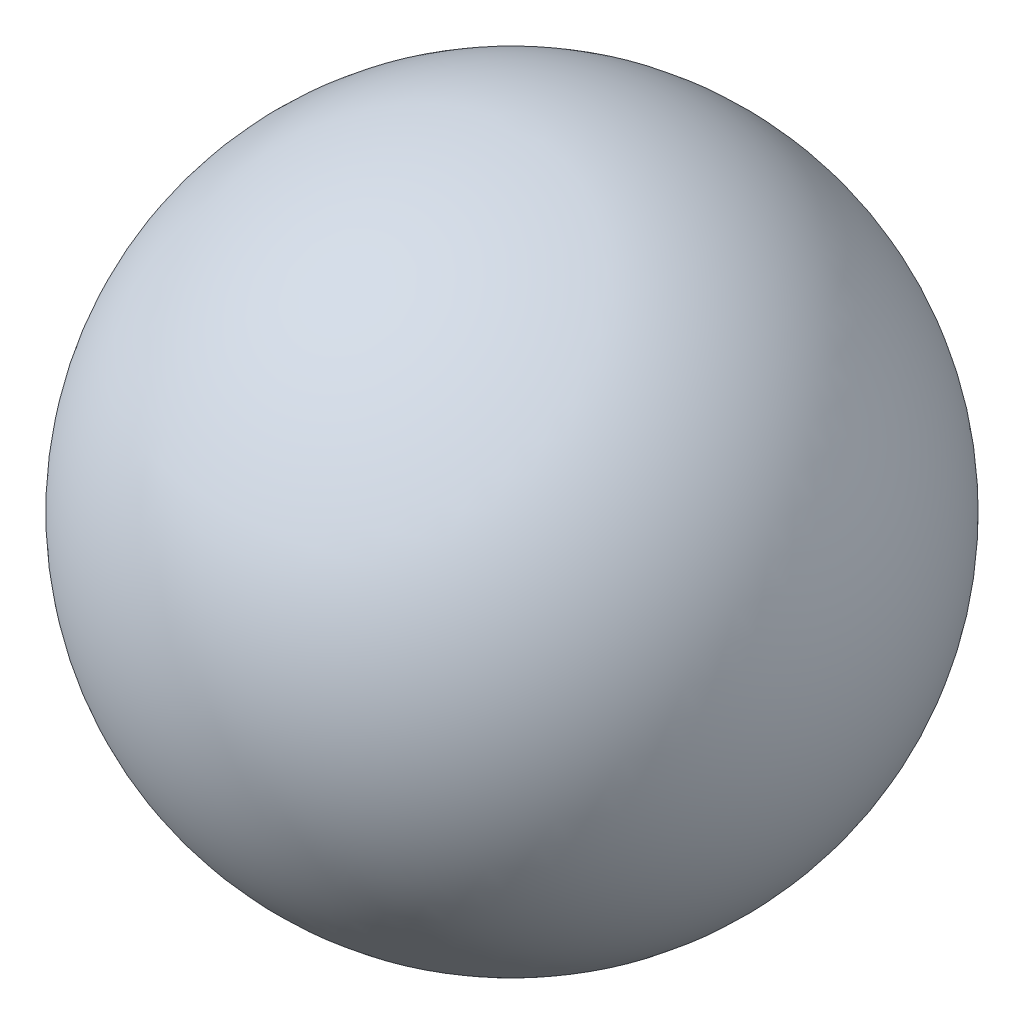
ISO-10303-21;
HEADER;
FILE_DESCRIPTION(('STEP AP214'),'2;1');
FILE_NAME('part.step','',(''),(''),'','','');
FILE_SCHEMA(('AUTOMOTIVE_DESIGN { 1 0 10303 214 1 1 1 1 }'));
ENDSEC;
DATA;
#1=APPLICATION_CONTEXT('core data for automotive mechanical design processes');
#2=APPLICATION_PROTOCOL_DEFINITION('international standard','automotive_design',2000,#1);
#3=PRODUCT_CONTEXT('',#1,'mechanical');
#4=PRODUCT('Part','Part','',(#3));
#5=PRODUCT_RELATED_PRODUCT_CATEGORY('part','',(#4));
#6=PRODUCT_DEFINITION_FORMATION('','',#4);
#7=PRODUCT_DEFINITION_CONTEXT('part definition',#1,'design');
#8=PRODUCT_DEFINITION('design','',#6,#7);
#9=PRODUCT_DEFINITION_SHAPE('','',#8);
#10=(LENGTH_UNIT() NAMED_UNIT(*) SI_UNIT(.MILLI.,.METRE.));
#11=(NAMED_UNIT(*) PLANE_ANGLE_UNIT() SI_UNIT($,.RADIAN.));
#12=(NAMED_UNIT(*) SI_UNIT($,.STERADIAN.) SOLID_ANGLE_UNIT());
#13=UNCERTAINTY_MEASURE_WITH_UNIT(LENGTH_MEASURE(1.E-05),#10,'distance_accuracy_value','');
#14=(GEOMETRIC_REPRESENTATION_CONTEXT(3) GLOBAL_UNCERTAINTY_ASSIGNED_CONTEXT((#13)) GLOBAL_UNIT_ASSIGNED_CONTEXT((#10,
#11,#12)) REPRESENTATION_CONTEXT('',''));
#15=CARTESIAN_POINT('',(0.,0.,0.));
#16=DIRECTION('',(0.,0.,1.));
#17=DIRECTION('',(1.,0.,0.));
#18=AXIS2_PLACEMENT_3D('',#15,#16,#17);
#19=CARTESIAN_POINT('',(0.,6.35,0.));
#20=DIRECTION('',(0.,-1.,0.));
#21=DIRECTION('',(-1.,0.,0.));
#22=AXIS2_PLACEMENT_3D('',#19,#20,#21);
#23=SPHERICAL_SURFACE('',#22,6.35);
#24=CARTESIAN_POINT('',(0.,0.,0.));
#25=VERTEX_POINT('',#24);
#26=VERTEX_LOOP('',#25);
#27=FACE_BOUND('',#26,.T.);
#28=ADVANCED_FACE('F29',(#27),#23,.T.);
#29=CLOSED_SHELL('',(#28));
#30=MANIFOLD_SOLID_BREP('B2',#29);
#31=ADVANCED_BREP_SHAPE_REPRESENTATION('',(#18,#30),#14);
#32=SHAPE_DEFINITION_REPRESENTATION(#9,#31);
ENDSEC;
END-ISO-10303-21;
